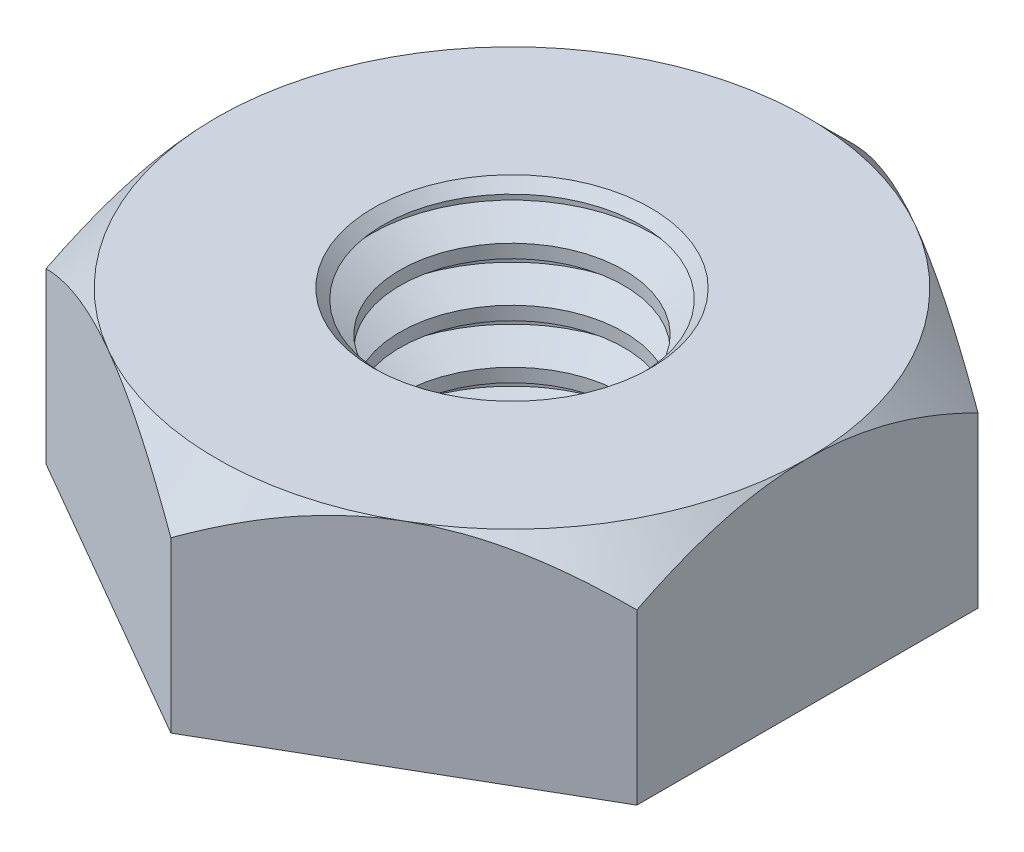
ISO-10303-21;
HEADER;
FILE_DESCRIPTION(('STEP AP214'),'2;1');
FILE_NAME('part.step','',(''),(''),'','','');
FILE_SCHEMA(('AUTOMOTIVE_DESIGN { 1 0 10303 214 1 1 1 1 }'));
ENDSEC;
DATA;
#1=APPLICATION_CONTEXT('core data for automotive mechanical design processes');
#2=APPLICATION_PROTOCOL_DEFINITION('international standard','automotive_design',2000,#1);
#3=PRODUCT_CONTEXT('',#1,'mechanical');
#4=PRODUCT('Part','Part','',(#3));
#5=PRODUCT_RELATED_PRODUCT_CATEGORY('part','',(#4));
#6=PRODUCT_DEFINITION_FORMATION('','',#4);
#7=PRODUCT_DEFINITION_CONTEXT('part definition',#1,'design');
#8=PRODUCT_DEFINITION('design','',#6,#7);
#9=PRODUCT_DEFINITION_SHAPE('','',#8);
#10=(LENGTH_UNIT() NAMED_UNIT(*) SI_UNIT(.MILLI.,.METRE.));
#11=(NAMED_UNIT(*) PLANE_ANGLE_UNIT() SI_UNIT($,.RADIAN.));
#12=(NAMED_UNIT(*) SI_UNIT($,.STERADIAN.) SOLID_ANGLE_UNIT());
#13=UNCERTAINTY_MEASURE_WITH_UNIT(LENGTH_MEASURE(1.E-05),#10,'distance_accuracy_value','');
#14=(GEOMETRIC_REPRESENTATION_CONTEXT(3) GLOBAL_UNCERTAINTY_ASSIGNED_CONTEXT((#13)) GLOBAL_UNIT_ASSIGNED_CONTEXT((#10,
#11,#12)) REPRESENTATION_CONTEXT('',''));
#15=CARTESIAN_POINT('',(0.,0.,0.));
#16=DIRECTION('',(0.,0.,1.));
#17=DIRECTION('',(1.,0.,0.));
#18=AXIS2_PLACEMENT_3D('',#15,#16,#17);
#19=CARTESIAN_POINT('',(0.,0.,-5.04098953786192));
#20=DIRECTION('',(0.,1.,0.));
#21=DIRECTION('',(0.,0.,1.));
#22=AXIS2_PLACEMENT_3D('',#19,#20,#21);
#23=PLANE('',#22);
#24=DIRECTION('',(-0.866025403784439,0.,-0.5));
#25=VECTOR('',#24,1.);
#26=CARTESIAN_POINT('',(4.365625,0.,-2.52049476893096));
#27=LINE('',#26,#25);
#28=CARTESIAN_POINT('',(4.365625,0.,-2.52049476893096));
#29=VERTEX_POINT('',#28);
#30=CARTESIAN_POINT('',(0.,0.,-5.04098953786192));
#31=VERTEX_POINT('',#30);
#32=EDGE_CURVE('E261',#29,#31,#27,.T.);
#33=ORIENTED_EDGE('',*,*,#32,.F.);
#34=DIRECTION('',(0.,0.,-1.));
#35=VECTOR('',#34,1.);
#36=CARTESIAN_POINT('',(4.365625,0.,2.52049476893096));
#37=LINE('',#36,#35);
#38=CARTESIAN_POINT('',(4.365625,0.,2.52049476893096));
#39=VERTEX_POINT('',#38);
#40=EDGE_CURVE('E268',#39,#29,#37,.T.);
#41=ORIENTED_EDGE('',*,*,#40,.F.);
#42=DIRECTION('',(0.866025403784439,0.,-0.5));
#43=VECTOR('',#42,1.);
#44=CARTESIAN_POINT('',(0.,0.,5.04098953786192));
#45=LINE('',#44,#43);
#46=CARTESIAN_POINT('',(0.,0.,5.04098953786192));
#47=VERTEX_POINT('',#46);
#48=EDGE_CURVE('E264',#47,#39,#45,.T.);
#49=ORIENTED_EDGE('',*,*,#48,.F.);
#50=DIRECTION('',(0.866025403784439,0.,0.5));
#51=VECTOR('',#50,1.);
#52=CARTESIAN_POINT('',(-4.365625,0.,2.52049476893096));
#53=LINE('',#52,#51);
#54=CARTESIAN_POINT('',(-4.365625,0.,2.52049476893096));
#55=VERTEX_POINT('',#54);
#56=EDGE_CURVE('E127',#55,#47,#53,.T.);
#57=ORIENTED_EDGE('',*,*,#56,.F.);
#58=DIRECTION('',(0.,0.,1.));
#59=VECTOR('',#58,1.);
#60=CARTESIAN_POINT('',(-4.365625,0.,-2.52049476893096));
#61=LINE('',#60,#59);
#62=CARTESIAN_POINT('',(-4.365625,0.,-2.52049476893096));
#63=VERTEX_POINT('',#62);
#64=EDGE_CURVE('E260',#63,#55,#61,.T.);
#65=ORIENTED_EDGE('',*,*,#64,.F.);
#66=DIRECTION('',(-0.866025403784439,0.,0.5));
#67=VECTOR('',#66,1.);
#68=CARTESIAN_POINT('',(0.,0.,-5.04098953786192));
#69=LINE('',#68,#67);
#70=EDGE_CURVE('E256',#31,#63,#69,.T.);
#71=ORIENTED_EDGE('',*,*,#70,.F.);
#72=EDGE_LOOP('',(#33,#41,#49,#57,#65,#71));
#73=FACE_BOUND('',#72,.T.);
#74=CARTESIAN_POINT('',(0.,0.,0.));
#75=DIRECTION('',(0.,1.,0.));
#76=DIRECTION('',(0.,0.,1.));
#77=AXIS2_PLACEMENT_3D('',#74,#75,#76);
#78=CIRCLE('',#77,1.65317020984131);
#79=CARTESIAN_POINT('',(0.,0.,1.65317020984131));
#80=VERTEX_POINT('',#79);
#81=EDGE_CURVE('E339',#80,#80,#78,.T.);
#82=ORIENTED_EDGE('',*,*,#81,.T.);
#83=EDGE_LOOP('',(#82));
#84=FACE_BOUND('',#83,.T.);
#85=ADVANCED_FACE('F34',(#73,#84),#23,.F.);
#86=CARTESIAN_POINT('',(0.,3.175,-5.04098953786192));
#87=DIRECTION('',(0.,1.,0.));
#88=DIRECTION('',(0.,0.,1.));
#89=AXIS2_PLACEMENT_3D('',#86,#87,#88);
#90=PLANE('',#89);
#91=CARTESIAN_POINT('',(0.,3.175,0.));
#92=DIRECTION('',(0.,1.,0.));
#93=DIRECTION('',(0.,0.,1.));
#94=AXIS2_PLACEMENT_3D('',#91,#92,#93);
#95=CIRCLE('',#94,2.05004520984131);
#96=CARTESIAN_POINT('',(0.,3.175,2.05004520984131));
#97=VERTEX_POINT('',#96);
#98=EDGE_CURVE('E12',#97,#97,#95,.F.);
#99=ORIENTED_EDGE('',*,*,#98,.T.);
#100=EDGE_LOOP('',(#99));
#101=FACE_BOUND('',#100,.T.);
#102=CARTESIAN_POINT('',(0.,3.175,0.));
#103=DIRECTION('',(0.,1.,0.));
#104=DIRECTION('',(0.,0.,1.));
#105=AXIS2_PLACEMENT_3D('',#102,#103,#104);
#106=CIRCLE('',#105,4.365625);
#107=CARTESIAN_POINT('',(-2.1828125,3.175,3.78074215339644));
#108=VERTEX_POINT('',#107);
#109=CARTESIAN_POINT('',(2.1828125,3.175,3.78074215339644));
#110=VERTEX_POINT('',#109);
#111=EDGE_CURVE('E109',#108,#110,#106,.T.);
#112=ORIENTED_EDGE('',*,*,#111,.T.);
#113=CARTESIAN_POINT('',(0.,3.175,0.));
#114=DIRECTION('',(0.,1.,0.));
#115=DIRECTION('',(0.,0.,1.));
#116=AXIS2_PLACEMENT_3D('',#113,#114,#115);
#117=CIRCLE('',#116,4.365625);
#118=CARTESIAN_POINT('',(4.365625,3.175,0.));
#119=VERTEX_POINT('',#118);
#120=EDGE_CURVE('E49',#110,#119,#117,.T.);
#121=ORIENTED_EDGE('',*,*,#120,.T.);
#122=CARTESIAN_POINT('',(2.1828125,3.175,-3.78074215339644));
#123=VERTEX_POINT('',#122);
#124=EDGE_CURVE('E142',#119,#123,#106,.T.);
#125=ORIENTED_EDGE('',*,*,#124,.T.);
#126=CARTESIAN_POINT('',(-2.1828125,3.175,-3.78074215339644));
#127=VERTEX_POINT('',#126);
#128=EDGE_CURVE('E146',#123,#127,#106,.T.);
#129=ORIENTED_EDGE('',*,*,#128,.T.);
#130=CARTESIAN_POINT('',(-4.365625,3.175,0.));
#131=VERTEX_POINT('',#130);
#132=EDGE_CURVE('E149',#127,#131,#106,.T.);
#133=ORIENTED_EDGE('',*,*,#132,.T.);
#134=EDGE_CURVE('E141',#131,#108,#106,.T.);
#135=ORIENTED_EDGE('',*,*,#134,.T.);
#136=EDGE_LOOP('',(#112,#121,#125,#129,#133,#135));
#137=FACE_BOUND('',#136,.T.);
#138=ADVANCED_FACE('F156',(#101,#137),#90,.T.);
#139=CARTESIAN_POINT('',(4.365625,3.175,-2.52049476893096));
#140=DIRECTION('',(-0.5,0.,0.866025403784439));
#141=DIRECTION('',(0.866025403784439,0.,0.5));
#142=AXIS2_PLACEMENT_3D('',#139,#140,#141);
#143=PLANE('',#142);
#144=CARTESIAN_POINT('',(4.365825,2.49951998811687,-2.52037929887713));
#145=CARTESIAN_POINT('',(4.29075926179721,2.5428556843937,-2.56371852303542));
#146=CARTESIAN_POINT('',(4.21511652405691,2.58486150694082,-2.60739087803202));
#147=CARTESIAN_POINT('',(4.06256384257887,2.66580884918542,-2.69546720974897));
#148=CARTESIAN_POINT('',(3.98565323405556,2.70474869521597,-2.73987157028344));
#149=CARTESIAN_POINT('',(3.75213521872552,2.81669452590529,-2.87469325929487));
#150=CARTESIAN_POINT('',(3.59355091897805,2.88434920314825,-2.96625194744332));
#151=CARTESIAN_POINT('',(3.27375295789606,3.00020333018922,-3.1508873863603));
#152=CARTESIAN_POINT('',(3.11262104210945,3.04869466909121,-3.24391694131474));
#153=CARTESIAN_POINT('',(2.86827398509099,3.1047873481826,-3.38499078046004));
#154=CARTESIAN_POINT('',(2.78646520845363,3.12070335091413,-3.43222309967369));
#155=CARTESIAN_POINT('',(2.62215493673047,3.14662706744581,-3.52708767928368));
#156=CARTESIAN_POINT('',(2.53965354705096,3.15663566431487,-3.57471987882366));
#157=CARTESIAN_POINT('',(2.33861197089847,3.17341632845891,-3.69079128693361));
#158=CARTESIAN_POINT('',(2.21985517581475,3.17693743451113,-3.7593555545433));
#159=CARTESIAN_POINT('',(1.9825555950651,3.17102881515628,-3.89636053136769));
#160=CARTESIAN_POINT('',(1.8640128990038,3.16159454983167,-3.96480118884914));
#161=CARTESIAN_POINT('',(1.62804507322986,3.13033130179081,-4.10103727657982));
#162=CARTESIAN_POINT('',(1.51062134300582,3.10848845674929,-4.16883189883392));
#163=CARTESIAN_POINT('',(1.27779209770266,3.05359557133502,-4.30325592628492));
#164=CARTESIAN_POINT('',(1.16238642859219,3.02054639026254,-4.36988542041185));
#165=CARTESIAN_POINT('',(0.957514998599648,2.95255207631629,-4.48816799566731));
#166=CARTESIAN_POINT('',(0.867595701157639,2.91939475932441,-4.5400829262508));
#167=CARTESIAN_POINT('',(0.689371364291638,2.84773661607479,-4.64298079511653));
#168=CARTESIAN_POINT('',(0.601066374030605,2.80923562738386,-4.69396370501452));
#169=CARTESIAN_POINT('',(0.42634877155884,2.72775327359755,-4.79483695983376));
#170=CARTESIAN_POINT('',(0.339931190163336,2.68478599766642,-4.84473017371517));
#171=CARTESIAN_POINT('',(0.168696346553443,2.59493525616829,-4.94359265676799));
#172=CARTESIAN_POINT('',(0.0838781412149917,2.54805419303698,-4.99256247045232));
#173=CARTESIAN_POINT('',(-0.000200000000001605,2.49951998811686,-5.04110500791576));
#174=B_SPLINE_CURVE_WITH_KNOTS('',3,(#144,#145,#146,#147,#148,#149,#150,#151,#152,#153,#154,
#155,#156,#157,#158,#159,#160,#161,#162,#163,#164,#165,#166,#167,#168,#169,#170,#171,#172,#173),
.UNSPECIFIED.,.F.,.F.,(4,2,2,2,2,2,2,2,2,2,2,2,2,2,4),(0.,0.290706610356815,0.581570828097977,
1.16643976138302,1.74202094661304,2.02924700568145,2.31643011786515,2.72731191561999,
3.13833773437735,3.54982363883689,3.96127799774813,4.28811145534738,4.61495484997813,
4.94079680753749,5.26644020086356),.UNSPECIFIED.);
#175=CARTESIAN_POINT('',(4.365625,2.49963546213808,-2.52049476893097));
#176=VERTEX_POINT('',#175);
#177=EDGE_CURVE('E271',#176,#123,#174,.T.);
#178=ORIENTED_EDGE('',*,*,#177,.F.);
#179=DIRECTION('',(0.,-1.,0.));
#180=VECTOR('',#179,1.);
#181=CARTESIAN_POINT('',(4.365625,3.175,-2.52049476893096));
#182=LINE('',#181,#180);
#183=EDGE_CURVE('E134',#176,#29,#182,.T.);
#184=ORIENTED_EDGE('',*,*,#183,.T.);
#185=ORIENTED_EDGE('',*,*,#32,.T.);
#186=DIRECTION('',(0.,-1.,0.));
#187=VECTOR('',#186,1.);
#188=CARTESIAN_POINT('',(0.,3.175,-5.04098953786192));
#189=LINE('',#188,#187);
#190=CARTESIAN_POINT('',(0.,2.49963546213808,-5.04098953786192));
#191=VERTEX_POINT('',#190);
#192=EDGE_CURVE('E139',#191,#31,#189,.T.);
#193=ORIENTED_EDGE('',*,*,#192,.F.);
#194=EDGE_CURVE('E208',#123,#191,#174,.T.);
#195=ORIENTED_EDGE('',*,*,#194,.F.);
#196=EDGE_LOOP('',(#178,#184,#185,#193,#195));
#197=FACE_BOUND('',#196,.T.);
#198=ADVANCED_FACE('F217',(#197),#143,.F.);
#199=CARTESIAN_POINT('',(0.,3.175,-5.04098953786192));
#200=DIRECTION('',(0.5,0.,0.866025403784439));
#201=DIRECTION('',(0.866025403784439,0.,-0.5));
#202=AXIS2_PLACEMENT_3D('',#199,#200,#201);
#203=PLANE('',#202);
#204=CARTESIAN_POINT('',(0.000199999999998374,2.49951998811686,-5.04110500791576));
#205=CARTESIAN_POINT('',(-0.0748657382027902,2.54285568439369,-4.99776578375746));
#206=CARTESIAN_POINT('',(-0.150508475943085,2.58486150694081,-4.95409342876086));
#207=CARTESIAN_POINT('',(-0.30306115742113,2.66580884918542,-4.86601709704392));
#208=CARTESIAN_POINT('',(-0.379971765944441,2.70474869521597,-4.82161273650944));
#209=CARTESIAN_POINT('',(-0.613489781274479,2.81669452590529,-4.68679104749802));
#210=CARTESIAN_POINT('',(-0.772074081021948,2.88434920314825,-4.59523235934957));
#211=CARTESIAN_POINT('',(-1.09187204210394,3.00020333018922,-4.41059692043259));
#212=CARTESIAN_POINT('',(-1.25300395789055,3.0486946690912,-4.31756736547815));
#213=CARTESIAN_POINT('',(-1.49735101490901,3.1047873481826,-4.17649352633285));
#214=CARTESIAN_POINT('',(-1.57915979154637,3.12070335091412,-4.1292612071192));
#215=CARTESIAN_POINT('',(-1.74347006326953,3.14662706744581,-4.03439662750921));
#216=CARTESIAN_POINT('',(-1.82597145294904,3.15663566431487,-3.98676442796922));
#217=CARTESIAN_POINT('',(-2.02701302910153,3.17341632845891,-3.87069301985927));
#218=CARTESIAN_POINT('',(-2.14576982418526,3.17693743451113,-3.80212875224959));
#219=CARTESIAN_POINT('',(-2.3830694049349,3.17102881515628,-3.6651237754252));
#220=CARTESIAN_POINT('',(-2.5016121009962,3.16159454983167,-3.59668311794374));
#221=CARTESIAN_POINT('',(-2.73757992677014,3.13033130179081,-3.46044703021306));
#222=CARTESIAN_POINT('',(-2.85500365699418,3.10848845674929,-3.39265240795897));
#223=CARTESIAN_POINT('',(-3.08783290229734,3.05359557133502,-3.25822838050797));
#224=CARTESIAN_POINT('',(-3.20323857140781,3.02054639026254,-3.19159888638103));
#225=CARTESIAN_POINT('',(-3.40811000140035,2.95255207631629,-3.07331631112557));
#226=CARTESIAN_POINT('',(-3.49802929884236,2.91939475932441,-3.02140138054209));
#227=CARTESIAN_POINT('',(-3.67625363570836,2.84773661607479,-2.91850351167636));
#228=CARTESIAN_POINT('',(-3.7645586259694,2.80923562738386,-2.86752060177837));
#229=CARTESIAN_POINT('',(-3.93927622844116,2.72775327359755,-2.76664734695913));
#230=CARTESIAN_POINT('',(-4.02569380983666,2.68478599766642,-2.71675413307772));
#231=CARTESIAN_POINT('',(-4.19692865344656,2.59493525616829,-2.6178916500249));
#232=CARTESIAN_POINT('',(-4.28174685878501,2.54805419303698,-2.56892183634056));
#233=CARTESIAN_POINT('',(-4.365825,2.49951998811686,-2.52037929887712));
#234=B_SPLINE_CURVE_WITH_KNOTS('',3,(#204,#205,#206,#207,#208,#209,#210,#211,#212,#213,#214,
#215,#216,#217,#218,#219,#220,#221,#222,#223,#224,#225,#226,#227,#228,#229,#230,#231,#232,#233),
.UNSPECIFIED.,.F.,.F.,(4,2,2,2,2,2,2,2,2,2,2,2,2,2,4),(0.,0.290706610356816,0.581570828097979,
1.16643976138302,1.74202094661305,2.02924700568145,2.31643011786515,2.72731191561999,
3.13833773437736,3.54982363883689,3.96127799774814,4.28811145534738,4.61495484997813,
4.94079680753749,5.26644020086356),.UNSPECIFIED.);
#235=EDGE_CURVE('E207',#191,#127,#234,.T.);
#236=ORIENTED_EDGE('',*,*,#235,.F.);
#237=ORIENTED_EDGE('',*,*,#192,.T.);
#238=ORIENTED_EDGE('',*,*,#70,.T.);
#239=DIRECTION('',(0.,-1.,0.));
#240=VECTOR('',#239,1.);
#241=CARTESIAN_POINT('',(-4.365625,3.175,-2.52049476893096));
#242=LINE('',#241,#240);
#243=CARTESIAN_POINT('',(-4.365625,2.49963546213808,-2.52049476893097));
#244=VERTEX_POINT('',#243);
#245=EDGE_CURVE('E132',#244,#63,#242,.T.);
#246=ORIENTED_EDGE('',*,*,#245,.F.);
#247=EDGE_CURVE('E202',#127,#244,#234,.T.);
#248=ORIENTED_EDGE('',*,*,#247,.F.);
#249=EDGE_LOOP('',(#236,#237,#238,#246,#248));
#250=FACE_BOUND('',#249,.T.);
#251=ADVANCED_FACE('F213',(#250),#203,.F.);
#252=CARTESIAN_POINT('',(-4.365625,3.175,-2.52049476893096));
#253=DIRECTION('',(1.,0.,0.));
#254=DIRECTION('',(0.,0.,-1.));
#255=AXIS2_PLACEMENT_3D('',#252,#253,#254);
#256=PLANE('',#255);
#257=CARTESIAN_POINT('',(-4.365625,0.704912579661346,-5.26006489056433));
#258=CARTESIAN_POINT('',(-4.365625,0.80267892983793,-5.1329841859818));
#259=CARTESIAN_POINT('',(-4.365625,0.899569220714148,-5.00521874689069));
#260=CARTESIAN_POINT('',(-4.365625,1.09119744425269,-4.7480385262146));
#261=CARTESIAN_POINT('',(-4.365625,1.18593486227081,-4.6186233615674));
#262=CARTESIAN_POINT('',(-4.365625,1.37353129405869,-4.35691808766542));
#263=CARTESIAN_POINT('',(-4.365625,1.46637017769497,-4.22461350133101));
#264=CARTESIAN_POINT('',(-4.365625,1.64881712700763,-3.95780239294876));
#265=CARTESIAN_POINT('',(-4.365625,1.73842541514534,-3.82329602344843));
#266=CARTESIAN_POINT('',(-4.365625,1.91923152416555,-3.54310038592311));
#267=CARTESIAN_POINT('',(-4.365625,2.0101698538518,-3.39724282764264));
#268=CARTESIAN_POINT('',(-4.365625,2.18640211336186,-3.10210247150436));
#269=CARTESIAN_POINT('',(-4.365625,2.27169509328475,-2.95281910287325));
#270=CARTESIAN_POINT('',(-4.365625,2.43482022055583,-2.65078628816501));
#271=CARTESIAN_POINT('',(-4.365625,2.51267426921964,-2.49804876401671));
#272=CARTESIAN_POINT('',(-4.365625,2.65917723070185,-2.18825597231203));
#273=CARTESIAN_POINT('',(-4.365625,2.72783048599296,-2.03120278408456));
#274=CARTESIAN_POINT('',(-4.365625,2.84724495878238,-1.72816423864564));
#275=CARTESIAN_POINT('',(-4.365625,2.89910313311,-1.5826155847136));
#276=CARTESIAN_POINT('',(-4.365625,2.99116920619303,-1.2878101350948));
#277=CARTESIAN_POINT('',(-4.365625,3.03137636289258,-1.1385531038777));
#278=CARTESIAN_POINT('',(-4.365625,3.09729383406965,-0.83982185436757));
#279=CARTESIAN_POINT('',(-4.365625,3.12326744800821,-0.690406728134636));
#280=CARTESIAN_POINT('',(-4.365625,3.16017597579481,-0.389720117691568));
#281=CARTESIAN_POINT('',(-4.365625,3.17111400974627,-0.238449025197239));
#282=CARTESIAN_POINT('',(-4.365625,3.1770196548063,0.0577907271338069));
#283=CARTESIAN_POINT('',(-4.365625,3.17266407223423,0.202746020460245));
#284=CARTESIAN_POINT('',(-4.365625,3.14977668074263,0.491525443469046));
#285=CARTESIAN_POINT('',(-4.365625,3.13124358417651,0.635349469207359));
#286=CARTESIAN_POINT('',(-4.365625,3.08073406930188,0.923262931460914));
#287=CARTESIAN_POINT('',(-4.365625,3.04852030695866,1.0673100183025));
#288=CARTESIAN_POINT('',(-4.365625,2.97243663849279,1.35223202145247));
#289=CARTESIAN_POINT('',(-4.365625,2.92856739438755,1.49310711743332));
#290=CARTESIAN_POINT('',(-4.365625,2.82829132796462,1.77944606428932));
#291=CARTESIAN_POINT('',(-4.365625,2.77130692063028,1.92470532838635));
#292=CARTESIAN_POINT('',(-4.365625,2.64853439221219,2.21148751875443));
#293=CARTESIAN_POINT('',(-4.365625,2.58274230151922,2.35300872565198));
#294=CARTESIAN_POINT('',(-4.365625,2.44391465170222,2.63298314411336));
#295=CARTESIAN_POINT('',(-4.365625,2.37085678258171,2.77142520257403));
#296=CARTESIAN_POINT('',(-4.365625,2.219105296034,3.04513698555421));
#297=CARTESIAN_POINT('',(-4.365625,2.14041254634271,3.18040719427782));
#298=CARTESIAN_POINT('',(-4.365625,1.98248926861825,3.44157865405833));
#299=CARTESIAN_POINT('',(-4.365625,1.9034771910414,3.56761269781683));
#300=CARTESIAN_POINT('',(-4.365625,1.74208988391647,3.81751542571875));
#301=CARTESIAN_POINT('',(-4.365625,1.65971440221839,3.9413839465179));
#302=CARTESIAN_POINT('',(-4.365625,1.4928706732036,4.18624305036429));
#303=CARTESIAN_POINT('',(-4.365625,1.40842453863359,4.30724875510755));
#304=CARTESIAN_POINT('',(-4.365625,1.23726856590243,4.54760013073487));
#305=CARTESIAN_POINT('',(-4.365625,1.1505593581824,4.66694625003688));
#306=CARTESIAN_POINT('',(-4.365625,1.06292381609541,4.78559619977847));
#307=B_SPLINE_CURVE_WITH_KNOTS('',3,(#257,#258,#259,#260,#261,#262,#263,#264,#265,#266,#267,
#268,#269,#270,#271,#272,#273,#274,#275,#276,#277,#278,#279,#280,#281,#282,#283,#284,#285,#286,
#287,#288,#289,#290,#291,#292,#293,#294,#295,#296,#297,#298,#299,#300,#301,#302,#303,#304,#305,
#306),.UNSPECIFIED.,.F.,.F.,(4,2,2,2,2,2,2,2,2,2,2,2,2,2,2,2,2,2,2,2,2,2,2,2,4),(0.,
0.481018057807076,0.962149918440635,1.44699361883673,1.93180386850032,2.44735513975326,
2.96299293959461,3.47706255965263,3.99088869478828,4.4540225010778,4.91718579798021,
5.37146415229228,5.82564822294318,6.25999088997209,6.69437301005721,7.13662055973024,
7.57884299564045,8.04659469469021,8.51455792293897,8.98400523488901,9.45338040975317,
9.89957717259381,10.3458074478608,10.7884549913015,11.2309805122862),.UNSPECIFIED.);
#308=EDGE_CURVE('E161',#244,#131,#307,.T.);
#309=ORIENTED_EDGE('',*,*,#308,.F.);
#310=ORIENTED_EDGE('',*,*,#245,.T.);
#311=ORIENTED_EDGE('',*,*,#64,.T.);
#312=DIRECTION('',(0.,-1.,0.));
#313=VECTOR('',#312,1.);
#314=CARTESIAN_POINT('',(-4.365625,3.175,2.52049476893096));
#315=LINE('',#314,#313);
#316=CARTESIAN_POINT('',(-4.36562500000001,2.49963546213808,2.52049476893096));
#317=VERTEX_POINT('',#316);
#318=EDGE_CURVE('E129',#317,#55,#315,.T.);
#319=ORIENTED_EDGE('',*,*,#318,.F.);
#320=EDGE_CURVE('E159',#131,#317,#307,.T.);
#321=ORIENTED_EDGE('',*,*,#320,.F.);
#322=EDGE_LOOP('',(#309,#310,#311,#319,#321));
#323=FACE_BOUND('',#322,.T.);
#324=ADVANCED_FACE('F216',(#323),#256,.F.);
#325=CARTESIAN_POINT('',(-4.365625,3.175,2.52049476893096));
#326=DIRECTION('',(0.5,0.,-0.866025403784439));
#327=DIRECTION('',(-0.866025403784439,0.,-0.5));
#328=AXIS2_PLACEMENT_3D('',#325,#326,#327);
#329=PLANE('',#328);
#330=CARTESIAN_POINT('',(-4.365825,2.49951998811686,2.52037929887712));
#331=CARTESIAN_POINT('',(-4.29075926179721,2.5428556843937,2.56371852303542));
#332=CARTESIAN_POINT('',(-4.21511652405692,2.58486150694082,2.60739087803202));
#333=CARTESIAN_POINT('',(-4.06256384257887,2.66580884918542,2.69546720974897));
#334=CARTESIAN_POINT('',(-3.98565323405556,2.70474869521597,2.73987157028344));
#335=CARTESIAN_POINT('',(-3.75213521872552,2.81669452590529,2.87469325929486));
#336=CARTESIAN_POINT('',(-3.59355091897806,2.88434920314825,2.96625194744331));
#337=CARTESIAN_POINT('',(-3.27375295789606,3.00020333018922,3.1508873863603));
#338=CARTESIAN_POINT('',(-3.11262104210946,3.04869466909121,3.24391694131473));
#339=CARTESIAN_POINT('',(-2.86827398509099,3.1047873481826,3.38499078046004));
#340=CARTESIAN_POINT('',(-2.78646520845364,3.12070335091413,3.43222309967369));
#341=CARTESIAN_POINT('',(-2.62215493673047,3.14662706744582,3.52708767928368));
#342=CARTESIAN_POINT('',(-2.53965354705096,3.15663566431487,3.57471987882366));
#343=CARTESIAN_POINT('',(-2.33861197089847,3.17341632845892,3.69079128693361));
#344=CARTESIAN_POINT('',(-2.21985517581475,3.17693743451114,3.75935555454329));
#345=CARTESIAN_POINT('',(-1.98255559506511,3.17102881515629,3.89636053136768));
#346=CARTESIAN_POINT('',(-1.8640128990038,3.16159454983167,3.96480118884914));
#347=CARTESIAN_POINT('',(-1.62804507322986,3.13033130179081,4.10103727657982));
#348=CARTESIAN_POINT('',(-1.51062134300582,3.10848845674929,4.16883189883391));
#349=CARTESIAN_POINT('',(-1.27779209770266,3.05359557133503,4.30325592628491));
#350=CARTESIAN_POINT('',(-1.16238642859219,3.02054639026254,4.36988542041185));
#351=CARTESIAN_POINT('',(-0.957514998599652,2.9525520763163,4.48816799566731));
#352=CARTESIAN_POINT('',(-0.867595701157642,2.91939475932441,4.54008292625079));
#353=CARTESIAN_POINT('',(-0.689371364291641,2.8477366160748,4.64298079511652));
#354=CARTESIAN_POINT('',(-0.601066374030608,2.80923562738387,4.69396370501451));
#355=CARTESIAN_POINT('',(-0.426348771558844,2.72775327359756,4.79483695983375));
#356=CARTESIAN_POINT('',(-0.339931190163339,2.68478599766643,4.84473017371517));
#357=CARTESIAN_POINT('',(-0.168696346553447,2.5949352561683,4.94359265676798));
#358=CARTESIAN_POINT('',(-0.0838781412149956,2.54805419303699,4.99256247045232));
#359=CARTESIAN_POINT('',(0.000199999999997297,2.49951998811687,5.04110500791575));
#360=B_SPLINE_CURVE_WITH_KNOTS('',3,(#330,#331,#332,#333,#334,#335,#336,#337,#338,#339,#340,
#341,#342,#343,#344,#345,#346,#347,#348,#349,#350,#351,#352,#353,#354,#355,#356,#357,#358,#359),
.UNSPECIFIED.,.F.,.F.,(4,2,2,2,2,2,2,2,2,2,2,2,2,2,4),(0.,0.290706610356816,0.581570828097978,
1.16643976138302,1.74202094661304,2.02924700568145,2.31643011786515,2.72731191561999,
3.13833773437736,3.54982363883689,3.96127799774813,4.28811145534738,4.61495484997813,
4.94079680753749,5.26644020086355),.UNSPECIFIED.);
#361=EDGE_CURVE('E114',#317,#108,#360,.T.);
#362=ORIENTED_EDGE('',*,*,#361,.F.);
#363=ORIENTED_EDGE('',*,*,#318,.T.);
#364=ORIENTED_EDGE('',*,*,#56,.T.);
#365=DIRECTION('',(0.,-1.,0.));
#366=VECTOR('',#365,1.);
#367=CARTESIAN_POINT('',(0.,3.175,5.04098953786192));
#368=LINE('',#367,#366);
#369=CARTESIAN_POINT('',(0.,2.49963546213808,5.04098953786192));
#370=VERTEX_POINT('',#369);
#371=EDGE_CURVE('E120',#370,#47,#368,.T.);
#372=ORIENTED_EDGE('',*,*,#371,.F.);
#373=EDGE_CURVE('E105',#108,#370,#360,.T.);
#374=ORIENTED_EDGE('',*,*,#373,.F.);
#375=EDGE_LOOP('',(#362,#363,#364,#372,#374));
#376=FACE_BOUND('',#375,.T.);
#377=ADVANCED_FACE('F125',(#376),#329,.F.);
#378=CARTESIAN_POINT('',(0.,3.175,5.04098953786192));
#379=DIRECTION('',(-0.5,0.,-0.866025403784439));
#380=DIRECTION('',(-0.866025403784439,0.,0.5));
#381=AXIS2_PLACEMENT_3D('',#378,#379,#380);
#382=PLANE('',#381);
#383=CARTESIAN_POINT('',(-0.00020000000000279,2.49951998811687,5.04110500791576));
#384=CARTESIAN_POINT('',(0.0748657382027853,2.5428556843937,4.99776578375746));
#385=CARTESIAN_POINT('',(0.15050847594308,2.58486150694082,4.95409342876086));
#386=CARTESIAN_POINT('',(0.303061157421125,2.66580884918542,4.86601709704391));
#387=CARTESIAN_POINT('',(0.379971765944435,2.70474869521597,4.82161273650944));
#388=CARTESIAN_POINT('',(0.613489781274473,2.8166945259053,4.68679104749801));
#389=CARTESIAN_POINT('',(0.772074081021943,2.88434920314826,4.59523235934957));
#390=CARTESIAN_POINT('',(1.09187204210394,3.00020333018922,4.41059692043258));
#391=CARTESIAN_POINT('',(1.25300395789054,3.04869466909121,4.31756736547815));
#392=CARTESIAN_POINT('',(1.49735101490901,3.1047873481826,4.17649352633284));
#393=CARTESIAN_POINT('',(1.57915979154636,3.12070335091413,4.12926120711919));
#394=CARTESIAN_POINT('',(1.74347006326953,3.14662706744582,4.0343966275092));
#395=CARTESIAN_POINT('',(1.82597145294903,3.15663566431487,3.98676442796922));
#396=CARTESIAN_POINT('',(2.02701302910153,3.17341632845892,3.87069301985927));
#397=CARTESIAN_POINT('',(2.14576982418525,3.17693743451114,3.80212875224959));
#398=CARTESIAN_POINT('',(2.38306940493489,3.17102881515629,3.6651237754252));
#399=CARTESIAN_POINT('',(2.5016121009962,3.16159454983167,3.59668311794374));
#400=CARTESIAN_POINT('',(2.73757992677014,3.13033130179081,3.46044703021306));
#401=CARTESIAN_POINT('',(2.85500365699418,3.10848845674929,3.39265240795896));
#402=CARTESIAN_POINT('',(3.08783290229733,3.05359557133503,3.25822838050797));
#403=CARTESIAN_POINT('',(3.20323857140781,3.02054639026254,3.19159888638103));
#404=CARTESIAN_POINT('',(3.40811000140035,2.9525520763163,3.07331631112557));
#405=CARTESIAN_POINT('',(3.49802929884236,2.91939475932441,3.02140138054209));
#406=CARTESIAN_POINT('',(3.67625363570836,2.8477366160748,2.91850351167636));
#407=CARTESIAN_POINT('',(3.76455862596939,2.80923562738387,2.86752060177836));
#408=CARTESIAN_POINT('',(3.93927622844116,2.72775327359755,2.76664734695912));
#409=CARTESIAN_POINT('',(4.02569380983666,2.68478599766643,2.71675413307771));
#410=CARTESIAN_POINT('',(4.19692865344655,2.5949352561683,2.6178916500249));
#411=CARTESIAN_POINT('',(4.281746858785,2.54805419303699,2.56892183634056));
#412=CARTESIAN_POINT('',(4.365825,2.49951998811687,2.52037929887712));
#413=B_SPLINE_CURVE_WITH_KNOTS('',3,(#383,#384,#385,#386,#387,#388,#389,#390,#391,#392,#393,
#394,#395,#396,#397,#398,#399,#400,#401,#402,#403,#404,#405,#406,#407,#408,#409,#410,#411,#412),
.UNSPECIFIED.,.F.,.F.,(4,2,2,2,2,2,2,2,2,2,2,2,2,2,4),(0.,0.290706610356815,0.581570828097978,
1.16643976138302,1.74202094661304,2.02924700568145,2.31643011786515,2.72731191561999,
3.13833773437735,3.54982363883689,3.96127799774813,4.28811145534738,4.61495484997813,
4.94079680753749,5.26644020086356),.UNSPECIFIED.);
#414=EDGE_CURVE('E108',#370,#110,#413,.T.);
#415=ORIENTED_EDGE('',*,*,#414,.F.);
#416=ORIENTED_EDGE('',*,*,#371,.T.);
#417=ORIENTED_EDGE('',*,*,#48,.T.);
#418=DIRECTION('',(0.,-1.,0.));
#419=VECTOR('',#418,1.);
#420=CARTESIAN_POINT('',(4.365625,3.175,2.52049476893096));
#421=LINE('',#420,#419);
#422=CARTESIAN_POINT('',(4.365625,2.49963546213808,2.52049476893097));
#423=VERTEX_POINT('',#422);
#424=EDGE_CURVE('E130',#423,#39,#421,.T.);
#425=ORIENTED_EDGE('',*,*,#424,.F.);
#426=EDGE_CURVE('E123',#110,#423,#413,.T.);
#427=ORIENTED_EDGE('',*,*,#426,.F.);
#428=EDGE_LOOP('',(#415,#416,#417,#425,#427));
#429=FACE_BOUND('',#428,.T.);
#430=ADVANCED_FACE('F118',(#429),#382,.F.);
#431=CARTESIAN_POINT('',(4.365625,3.175,2.52049476893096));
#432=DIRECTION('',(-1.,0.,0.));
#433=DIRECTION('',(0.,0.,1.));
#434=AXIS2_PLACEMENT_3D('',#431,#432,#433);
#435=PLANE('',#434);
#436=CARTESIAN_POINT('',(4.365625,0.704912579661347,-5.26006489056433));
#437=CARTESIAN_POINT('',(4.365625,0.802678929837931,-5.1329841859818));
#438=CARTESIAN_POINT('',(4.365625,0.899569220714149,-5.0052187468907));
#439=CARTESIAN_POINT('',(4.365625,1.09119744425269,-4.7480385262146));
#440=CARTESIAN_POINT('',(4.365625,1.18593486227081,-4.6186233615674));
#441=CARTESIAN_POINT('',(4.365625,1.3735312940587,-4.35691808766542));
#442=CARTESIAN_POINT('',(4.365625,1.46637017769497,-4.22461350133101));
#443=CARTESIAN_POINT('',(4.365625,1.64881712700764,-3.95780239294876));
#444=CARTESIAN_POINT('',(4.365625,1.73842541514534,-3.82329602344843));
#445=CARTESIAN_POINT('',(4.365625,1.91923152416555,-3.54310038592311));
#446=CARTESIAN_POINT('',(4.365625,2.0101698538518,-3.39724282764265));
#447=CARTESIAN_POINT('',(4.365625,2.18640211336186,-3.10210247150436));
#448=CARTESIAN_POINT('',(4.365625,2.27169509328475,-2.95281910287325));
#449=CARTESIAN_POINT('',(4.365625,2.43482022055583,-2.65078628816501));
#450=CARTESIAN_POINT('',(4.365625,2.51267426921964,-2.49804876401671));
#451=CARTESIAN_POINT('',(4.365625,2.65917723070185,-2.18825597231203));
#452=CARTESIAN_POINT('',(4.365625,2.72783048599296,-2.03120278408456));
#453=CARTESIAN_POINT('',(4.365625,2.84724495878238,-1.72816423864564));
#454=CARTESIAN_POINT('',(4.365625,2.89910313311001,-1.58261558471361));
#455=CARTESIAN_POINT('',(4.365625,2.99116920619303,-1.2878101350948));
#456=CARTESIAN_POINT('',(4.365625,3.03137636289259,-1.1385531038777));
#457=CARTESIAN_POINT('',(4.365625,3.09729383406965,-0.839821854367571));
#458=CARTESIAN_POINT('',(4.365625,3.12326744800821,-0.690406728134637));
#459=CARTESIAN_POINT('',(4.365625,3.16017597579481,-0.389720117691569));
#460=CARTESIAN_POINT('',(4.365625,3.17111400974628,-0.23844902519724));
#461=CARTESIAN_POINT('',(4.365625,3.1770196548063,0.0577907271338055));
#462=CARTESIAN_POINT('',(4.365625,3.17266407223424,0.202746020460243));
#463=CARTESIAN_POINT('',(4.365625,3.14977668074263,0.491525443469045));
#464=CARTESIAN_POINT('',(4.365625,3.13124358417652,0.635349469207358));
#465=CARTESIAN_POINT('',(4.365625,3.08073406930189,0.923262931460913));
#466=CARTESIAN_POINT('',(4.365625,3.04852030695866,1.0673100183025));
#467=CARTESIAN_POINT('',(4.365625,2.97243663849279,1.35223202145247));
#468=CARTESIAN_POINT('',(4.365625,2.92856739438756,1.49310711743332));
#469=CARTESIAN_POINT('',(4.365625,2.82829132796462,1.77944606428932));
#470=CARTESIAN_POINT('',(4.365625,2.77130692063029,1.92470532838634));
#471=CARTESIAN_POINT('',(4.365625,2.64853439221219,2.21148751875443));
#472=CARTESIAN_POINT('',(4.365625,2.58274230151922,2.35300872565198));
#473=CARTESIAN_POINT('',(4.365625,2.44391465170222,2.63298314411336));
#474=CARTESIAN_POINT('',(4.365625,2.37085678258172,2.77142520257403));
#475=CARTESIAN_POINT('',(4.365625,2.219105296034,3.04513698555421));
#476=CARTESIAN_POINT('',(4.365625,2.14041254634271,3.18040719427782));
#477=CARTESIAN_POINT('',(4.365625,1.98248926861825,3.44157865405832));
#478=CARTESIAN_POINT('',(4.365625,1.90347719104141,3.56761269781683));
#479=CARTESIAN_POINT('',(4.365625,1.74208988391648,3.81751542571875));
#480=CARTESIAN_POINT('',(4.365625,1.6597144022184,3.9413839465179));
#481=CARTESIAN_POINT('',(4.365625,1.49287067320361,4.18624305036429));
#482=CARTESIAN_POINT('',(4.365625,1.4084245386336,4.30724875510754));
#483=CARTESIAN_POINT('',(4.365625,1.23726856590244,4.54760013073487));
#484=CARTESIAN_POINT('',(4.365625,1.1505593581824,4.66694625003688));
#485=CARTESIAN_POINT('',(4.365625,1.06292381609542,4.78559619977847));
#486=B_SPLINE_CURVE_WITH_KNOTS('',3,(#436,#437,#438,#439,#440,#441,#442,#443,#444,#445,#446,
#447,#448,#449,#450,#451,#452,#453,#454,#455,#456,#457,#458,#459,#460,#461,#462,#463,#464,#465,
#466,#467,#468,#469,#470,#471,#472,#473,#474,#475,#476,#477,#478,#479,#480,#481,#482,#483,#484,
#485),.UNSPECIFIED.,.F.,.F.,(4,2,2,2,2,2,2,2,2,2,2,2,2,2,2,2,2,2,2,2,2,2,2,2,4),(0.,
0.481018057807077,0.962149918440637,1.44699361883673,1.93180386850032,2.44735513975326,
2.96299293959462,3.47706255965263,3.99088869478828,4.4540225010778,4.91718579798021,
5.37146415229229,5.82564822294318,6.25999088997209,6.69437301005722,7.13662055973025,
7.57884299564045,8.04659469469021,8.51455792293897,8.98400523488901,9.45338040975317,
9.89957717259381,10.3458074478608,10.7884549913015,11.2309805122862),.UNSPECIFIED.);
#487=EDGE_CURVE('E292',#423,#119,#486,.F.);
#488=ORIENTED_EDGE('',*,*,#487,.F.);
#489=ORIENTED_EDGE('',*,*,#424,.T.);
#490=ORIENTED_EDGE('',*,*,#40,.T.);
#491=ORIENTED_EDGE('',*,*,#183,.F.);
#492=EDGE_CURVE('E192',#119,#176,#486,.F.);
#493=ORIENTED_EDGE('',*,*,#492,.F.);
#494=EDGE_LOOP('',(#488,#489,#490,#491,#493));
#495=FACE_BOUND('',#494,.T.);
#496=ADVANCED_FACE('F234',(#495),#435,.F.);
#497=CARTESIAN_POINT('',(0.,3.175,0.));
#498=DIRECTION('',(0.,-1.,0.));
#499=DIRECTION('',(0.,0.,-1.));
#500=AXIS2_PLACEMENT_3D('',#497,#498,#499);
#501=CONICAL_SURFACE('',#500,4.365625,0.785398163397454);
#502=ORIENTED_EDGE('',*,*,#373,.T.);
#503=ORIENTED_EDGE('',*,*,#414,.T.);
#504=ORIENTED_EDGE('',*,*,#111,.F.);
#505=EDGE_LOOP('',(#502,#503,#504));
#506=FACE_BOUND('',#505,.T.);
#507=ADVANCED_FACE('F107',(#506),#501,.T.);
#508=ORIENTED_EDGE('',*,*,#320,.T.);
#509=ORIENTED_EDGE('',*,*,#361,.T.);
#510=ORIENTED_EDGE('',*,*,#134,.F.);
#511=EDGE_LOOP('',(#508,#509,#510));
#512=FACE_BOUND('',#511,.T.);
#513=ADVANCED_FACE('F158',(#512),#501,.T.);
#514=ORIENTED_EDGE('',*,*,#247,.T.);
#515=ORIENTED_EDGE('',*,*,#308,.T.);
#516=ORIENTED_EDGE('',*,*,#132,.F.);
#517=EDGE_LOOP('',(#514,#515,#516));
#518=FACE_BOUND('',#517,.T.);
#519=ADVANCED_FACE('F276',(#518),#501,.T.);
#520=ORIENTED_EDGE('',*,*,#194,.T.);
#521=ORIENTED_EDGE('',*,*,#235,.T.);
#522=ORIENTED_EDGE('',*,*,#128,.F.);
#523=EDGE_LOOP('',(#520,#521,#522));
#524=FACE_BOUND('',#523,.T.);
#525=ADVANCED_FACE('F185',(#524),#501,.T.);
#526=ORIENTED_EDGE('',*,*,#177,.T.);
#527=ORIENTED_EDGE('',*,*,#124,.F.);
#528=ORIENTED_EDGE('',*,*,#492,.T.);
#529=EDGE_LOOP('',(#526,#527,#528));
#530=FACE_BOUND('',#529,.T.);
#531=ADVANCED_FACE('F179',(#530),#501,.T.);
#532=ORIENTED_EDGE('',*,*,#426,.T.);
#533=ORIENTED_EDGE('',*,*,#487,.T.);
#534=ORIENTED_EDGE('',*,*,#120,.F.);
#535=EDGE_LOOP('',(#532,#533,#534));
#536=FACE_BOUND('',#535,.T.);
#537=ADVANCED_FACE('F184',(#536),#501,.T.);
#538=CARTESIAN_POINT('',(0.,2.926953125,0.));
#539=DIRECTION('',(0.,-1.,0.));
#540=DIRECTION('',(0.,0.,-1.));
#541=AXIS2_PLACEMENT_3D('',#538,#539,#540);
#542=CONICAL_SURFACE('',#541,2.0828,1.0471975511966);
#543=CARTESIAN_POINT('',(0.,3.02973366787305,0.));
#544=DIRECTION('',(0.,1.,0.));
#545=DIRECTION('',(0.,0.,1.));
#546=AXIS2_PLACEMENT_3D('',#543,#544,#545);
#547=CIRCLE('',#546,1.90477887771436);
#548=CARTESIAN_POINT('',(0.,3.02973366787305,1.90477887771436));
#549=VERTEX_POINT('',#548);
#550=EDGE_CURVE('E42',#549,#549,#547,.T.);
#551=ORIENTED_EDGE('',*,*,#550,.T.);
#552=EDGE_LOOP('',(#551));
#553=FACE_BOUND('',#552,.T.);
#554=CARTESIAN_POINT('',(0.,2.926953125,0.));
#555=DIRECTION('',(0.,1.,0.));
#556=DIRECTION('',(0.,0.,1.));
#557=AXIS2_PLACEMENT_3D('',#554,#555,#556);
#558=CIRCLE('',#557,2.0828);
#559=CARTESIAN_POINT('',(0.,2.926953125,2.0828));
#560=VERTEX_POINT('',#559);
#561=EDGE_CURVE('E293',#560,#560,#558,.T.);
#562=ORIENTED_EDGE('',*,*,#561,.F.);
#563=EDGE_LOOP('',(#562));
#564=FACE_BOUND('',#563,.T.);
#565=ADVANCED_FACE('F187',(#553,#564),#542,.F.);
#566=CARTESIAN_POINT('',(0.,1.66357854098429,0.));
#567=DIRECTION('',(0.,1.,0.));
#568=DIRECTION('',(0.,0.,1.));
#569=AXIS2_PLACEMENT_3D('',#566,#567,#568);
#570=CYLINDRICAL_SURFACE('',#569,2.0828);
#571=ORIENTED_EDGE('',*,*,#561,.T.);
#572=EDGE_LOOP('',(#571));
#573=FACE_BOUND('',#572,.T.);
#574=CARTESIAN_POINT('',(0.,2.827734375,0.));
#575=DIRECTION('',(0.,1.,0.));
#576=DIRECTION('',(0.,0.,1.));
#577=AXIS2_PLACEMENT_3D('',#574,#575,#576);
#578=CIRCLE('',#577,2.0828);
#579=CARTESIAN_POINT('',(0.,2.827734375,2.0828));
#580=VERTEX_POINT('',#579);
#581=EDGE_CURVE('E295',#580,#580,#578,.T.);
#582=ORIENTED_EDGE('',*,*,#581,.F.);
#583=EDGE_LOOP('',(#582));
#584=FACE_BOUND('',#583,.T.);
#585=ADVANCED_FACE('F291',(#573,#584),#570,.F.);
#586=CARTESIAN_POINT('',(0.,2.5796875,0.));
#587=DIRECTION('',(0.,1.,0.));
#588=DIRECTION('',(0.,0.,1.));
#589=AXIS2_PLACEMENT_3D('',#586,#587,#588);
#590=CONICAL_SURFACE('',#589,1.65317020984131,1.0471975511966);
#591=ORIENTED_EDGE('',*,*,#581,.T.);
#592=EDGE_LOOP('',(#591));
#593=FACE_BOUND('',#592,.T.);
#594=CARTESIAN_POINT('',(0.,2.5796875,0.));
#595=DIRECTION('',(0.,1.,0.));
#596=DIRECTION('',(0.,0.,1.));
#597=AXIS2_PLACEMENT_3D('',#594,#595,#596);
#598=CIRCLE('',#597,1.65317020984131);
#599=CARTESIAN_POINT('',(0.,2.5796875,1.65317020984131));
#600=VERTEX_POINT('',#599);
#601=EDGE_CURVE('E300',#600,#600,#598,.T.);
#602=ORIENTED_EDGE('',*,*,#601,.F.);
#603=EDGE_LOOP('',(#602));
#604=FACE_BOUND('',#603,.T.);
#605=ADVANCED_FACE('F399',(#593,#604),#590,.F.);
#606=CARTESIAN_POINT('',(0.,1.66357854098429,0.));
#607=DIRECTION('',(0.,1.,0.));
#608=DIRECTION('',(0.,0.,1.));
#609=AXIS2_PLACEMENT_3D('',#606,#607,#608);
#610=CYLINDRICAL_SURFACE('',#609,1.65317020984131);
#611=ORIENTED_EDGE('',*,*,#601,.T.);
#612=EDGE_LOOP('',(#611));
#613=FACE_BOUND('',#612,.T.);
#614=CARTESIAN_POINT('',(0.,2.38125,0.));
#615=DIRECTION('',(0.,1.,0.));
#616=DIRECTION('',(0.,0.,1.));
#617=AXIS2_PLACEMENT_3D('',#614,#615,#616);
#618=CIRCLE('',#617,1.65317020984131);
#619=CARTESIAN_POINT('',(0.,2.38125,1.65317020984131));
#620=VERTEX_POINT('',#619);
#621=EDGE_CURVE('E303',#620,#620,#618,.T.);
#622=ORIENTED_EDGE('',*,*,#621,.F.);
#623=EDGE_LOOP('',(#622));
#624=FACE_BOUND('',#623,.T.);
#625=ADVANCED_FACE('F395',(#613,#624),#610,.F.);
#626=CARTESIAN_POINT('',(0.,2.133203125,0.));
#627=DIRECTION('',(0.,-1.,0.));
#628=DIRECTION('',(0.,0.,-1.));
#629=AXIS2_PLACEMENT_3D('',#626,#627,#628);
#630=CONICAL_SURFACE('',#629,2.0828,1.0471975511966);
#631=ORIENTED_EDGE('',*,*,#621,.T.);
#632=EDGE_LOOP('',(#631));
#633=FACE_BOUND('',#632,.T.);
#634=CARTESIAN_POINT('',(0.,2.133203125,0.));
#635=DIRECTION('',(0.,1.,0.));
#636=DIRECTION('',(0.,0.,1.));
#637=AXIS2_PLACEMENT_3D('',#634,#635,#636);
#638=CIRCLE('',#637,2.0828);
#639=CARTESIAN_POINT('',(0.,2.133203125,2.0828));
#640=VERTEX_POINT('',#639);
#641=EDGE_CURVE('E306',#640,#640,#638,.T.);
#642=ORIENTED_EDGE('',*,*,#641,.F.);
#643=EDGE_LOOP('',(#642));
#644=FACE_BOUND('',#643,.T.);
#645=ADVANCED_FACE('F391',(#633,#644),#630,.F.);
#646=CARTESIAN_POINT('',(0.,0.869828540984293,0.));
#647=DIRECTION('',(0.,1.,0.));
#648=DIRECTION('',(0.,0.,1.));
#649=AXIS2_PLACEMENT_3D('',#646,#647,#648);
#650=CYLINDRICAL_SURFACE('',#649,2.0828);
#651=ORIENTED_EDGE('',*,*,#641,.T.);
#652=EDGE_LOOP('',(#651));
#653=FACE_BOUND('',#652,.T.);
#654=CARTESIAN_POINT('',(0.,2.033984375,0.));
#655=DIRECTION('',(0.,1.,0.));
#656=DIRECTION('',(0.,0.,1.));
#657=AXIS2_PLACEMENT_3D('',#654,#655,#656);
#658=CIRCLE('',#657,2.0828);
#659=CARTESIAN_POINT('',(0.,2.033984375,2.0828));
#660=VERTEX_POINT('',#659);
#661=EDGE_CURVE('E309',#660,#660,#658,.T.);
#662=ORIENTED_EDGE('',*,*,#661,.F.);
#663=EDGE_LOOP('',(#662));
#664=FACE_BOUND('',#663,.T.);
#665=ADVANCED_FACE('F387',(#653,#664),#650,.F.);
#666=CARTESIAN_POINT('',(0.,1.7859375,0.));
#667=DIRECTION('',(0.,1.,0.));
#668=DIRECTION('',(0.,0.,1.));
#669=AXIS2_PLACEMENT_3D('',#666,#667,#668);
#670=CONICAL_SURFACE('',#669,1.65317020984131,1.0471975511966);
#671=ORIENTED_EDGE('',*,*,#661,.T.);
#672=EDGE_LOOP('',(#671));
#673=FACE_BOUND('',#672,.T.);
#674=CARTESIAN_POINT('',(0.,1.7859375,0.));
#675=DIRECTION('',(0.,1.,0.));
#676=DIRECTION('',(0.,0.,1.));
#677=AXIS2_PLACEMENT_3D('',#674,#675,#676);
#678=CIRCLE('',#677,1.65317020984131);
#679=CARTESIAN_POINT('',(0.,1.7859375,1.65317020984131));
#680=VERTEX_POINT('',#679);
#681=EDGE_CURVE('E312',#680,#680,#678,.T.);
#682=ORIENTED_EDGE('',*,*,#681,.F.);
#683=EDGE_LOOP('',(#682));
#684=FACE_BOUND('',#683,.T.);
#685=ADVANCED_FACE('F383',(#673,#684),#670,.F.);
#686=CARTESIAN_POINT('',(0.,0.869828540984293,0.));
#687=DIRECTION('',(0.,1.,0.));
#688=DIRECTION('',(0.,0.,1.));
#689=AXIS2_PLACEMENT_3D('',#686,#687,#688);
#690=CYLINDRICAL_SURFACE('',#689,1.65317020984131);
#691=ORIENTED_EDGE('',*,*,#681,.T.);
#692=EDGE_LOOP('',(#691));
#693=FACE_BOUND('',#692,.T.);
#694=CARTESIAN_POINT('',(0.,1.5875,0.));
#695=DIRECTION('',(0.,1.,0.));
#696=DIRECTION('',(0.,0.,1.));
#697=AXIS2_PLACEMENT_3D('',#694,#695,#696);
#698=CIRCLE('',#697,1.65317020984131);
#699=CARTESIAN_POINT('',(0.,1.5875,1.65317020984131));
#700=VERTEX_POINT('',#699);
#701=EDGE_CURVE('E315',#700,#700,#698,.T.);
#702=ORIENTED_EDGE('',*,*,#701,.F.);
#703=EDGE_LOOP('',(#702));
#704=FACE_BOUND('',#703,.T.);
#705=ADVANCED_FACE('F379',(#693,#704),#690,.F.);
#706=CARTESIAN_POINT('',(0.,1.339453125,0.));
#707=DIRECTION('',(0.,-1.,0.));
#708=DIRECTION('',(0.,0.,-1.));
#709=AXIS2_PLACEMENT_3D('',#706,#707,#708);
#710=CONICAL_SURFACE('',#709,2.0828,1.0471975511966);
#711=ORIENTED_EDGE('',*,*,#701,.T.);
#712=EDGE_LOOP('',(#711));
#713=FACE_BOUND('',#712,.T.);
#714=CARTESIAN_POINT('',(0.,1.339453125,0.));
#715=DIRECTION('',(0.,1.,0.));
#716=DIRECTION('',(0.,0.,1.));
#717=AXIS2_PLACEMENT_3D('',#714,#715,#716);
#718=CIRCLE('',#717,2.0828);
#719=CARTESIAN_POINT('',(0.,1.339453125,2.0828));
#720=VERTEX_POINT('',#719);
#721=EDGE_CURVE('E318',#720,#720,#718,.T.);
#722=ORIENTED_EDGE('',*,*,#721,.F.);
#723=EDGE_LOOP('',(#722));
#724=FACE_BOUND('',#723,.T.);
#725=ADVANCED_FACE('F375',(#713,#724),#710,.F.);
#726=CARTESIAN_POINT('',(0.,0.0760785409842932,0.));
#727=DIRECTION('',(0.,1.,0.));
#728=DIRECTION('',(0.,0.,1.));
#729=AXIS2_PLACEMENT_3D('',#726,#727,#728);
#730=CYLINDRICAL_SURFACE('',#729,2.0828);
#731=ORIENTED_EDGE('',*,*,#721,.T.);
#732=EDGE_LOOP('',(#731));
#733=FACE_BOUND('',#732,.T.);
#734=CARTESIAN_POINT('',(0.,1.240234375,0.));
#735=DIRECTION('',(0.,1.,0.));
#736=DIRECTION('',(0.,0.,1.));
#737=AXIS2_PLACEMENT_3D('',#734,#735,#736);
#738=CIRCLE('',#737,2.0828);
#739=CARTESIAN_POINT('',(0.,1.240234375,2.0828));
#740=VERTEX_POINT('',#739);
#741=EDGE_CURVE('E321',#740,#740,#738,.T.);
#742=ORIENTED_EDGE('',*,*,#741,.F.);
#743=EDGE_LOOP('',(#742));
#744=FACE_BOUND('',#743,.T.);
#745=ADVANCED_FACE('F371',(#733,#744),#730,.F.);
#746=CARTESIAN_POINT('',(0.,0.992187499999999,0.));
#747=DIRECTION('',(0.,1.,0.));
#748=DIRECTION('',(0.,0.,1.));
#749=AXIS2_PLACEMENT_3D('',#746,#747,#748);
#750=CONICAL_SURFACE('',#749,1.65317020984131,1.0471975511966);
#751=ORIENTED_EDGE('',*,*,#741,.T.);
#752=EDGE_LOOP('',(#751));
#753=FACE_BOUND('',#752,.T.);
#754=CARTESIAN_POINT('',(0.,0.992187499999999,0.));
#755=DIRECTION('',(0.,1.,0.));
#756=DIRECTION('',(0.,0.,1.));
#757=AXIS2_PLACEMENT_3D('',#754,#755,#756);
#758=CIRCLE('',#757,1.65317020984131);
#759=CARTESIAN_POINT('',(0.,0.992187499999999,1.65317020984131));
#760=VERTEX_POINT('',#759);
#761=EDGE_CURVE('E324',#760,#760,#758,.T.);
#762=ORIENTED_EDGE('',*,*,#761,.F.);
#763=EDGE_LOOP('',(#762));
#764=FACE_BOUND('',#763,.T.);
#765=ADVANCED_FACE('F367',(#753,#764),#750,.F.);
#766=CARTESIAN_POINT('',(0.,0.0760785409842932,0.));
#767=DIRECTION('',(0.,1.,0.));
#768=DIRECTION('',(0.,0.,1.));
#769=AXIS2_PLACEMENT_3D('',#766,#767,#768);
#770=CYLINDRICAL_SURFACE('',#769,1.65317020984131);
#771=ORIENTED_EDGE('',*,*,#761,.T.);
#772=EDGE_LOOP('',(#771));
#773=FACE_BOUND('',#772,.T.);
#774=CARTESIAN_POINT('',(0.,0.79375,0.));
#775=DIRECTION('',(0.,1.,0.));
#776=DIRECTION('',(0.,0.,1.));
#777=AXIS2_PLACEMENT_3D('',#774,#775,#776);
#778=CIRCLE('',#777,1.65317020984131);
#779=CARTESIAN_POINT('',(0.,0.79375,1.65317020984131));
#780=VERTEX_POINT('',#779);
#781=EDGE_CURVE('E327',#780,#780,#778,.T.);
#782=ORIENTED_EDGE('',*,*,#781,.F.);
#783=EDGE_LOOP('',(#782));
#784=FACE_BOUND('',#783,.T.);
#785=ADVANCED_FACE('F363',(#773,#784),#770,.F.);
#786=CARTESIAN_POINT('',(0.,0.545703125,0.));
#787=DIRECTION('',(0.,-1.,0.));
#788=DIRECTION('',(0.,0.,-1.));
#789=AXIS2_PLACEMENT_3D('',#786,#787,#788);
#790=CONICAL_SURFACE('',#789,2.0828,1.0471975511966);
#791=ORIENTED_EDGE('',*,*,#781,.T.);
#792=EDGE_LOOP('',(#791));
#793=FACE_BOUND('',#792,.T.);
#794=CARTESIAN_POINT('',(0.,0.545703125,0.));
#795=DIRECTION('',(0.,1.,0.));
#796=DIRECTION('',(0.,0.,1.));
#797=AXIS2_PLACEMENT_3D('',#794,#795,#796);
#798=CIRCLE('',#797,2.0828);
#799=CARTESIAN_POINT('',(0.,0.545703125,2.0828));
#800=VERTEX_POINT('',#799);
#801=EDGE_CURVE('E330',#800,#800,#798,.T.);
#802=ORIENTED_EDGE('',*,*,#801,.F.);
#803=EDGE_LOOP('',(#802));
#804=FACE_BOUND('',#803,.T.);
#805=ADVANCED_FACE('F359',(#793,#804),#790,.F.);
#806=CARTESIAN_POINT('',(0.,-0.717671459015707,0.));
#807=DIRECTION('',(0.,1.,0.));
#808=DIRECTION('',(0.,0.,1.));
#809=AXIS2_PLACEMENT_3D('',#806,#807,#808);
#810=CYLINDRICAL_SURFACE('',#809,2.0828);
#811=ORIENTED_EDGE('',*,*,#801,.T.);
#812=EDGE_LOOP('',(#811));
#813=FACE_BOUND('',#812,.T.);
#814=CARTESIAN_POINT('',(0.,0.446484375,0.));
#815=DIRECTION('',(0.,1.,0.));
#816=DIRECTION('',(0.,0.,1.));
#817=AXIS2_PLACEMENT_3D('',#814,#815,#816);
#818=CIRCLE('',#817,2.0828);
#819=CARTESIAN_POINT('',(0.,0.446484375,2.0828));
#820=VERTEX_POINT('',#819);
#821=EDGE_CURVE('E333',#820,#820,#818,.T.);
#822=ORIENTED_EDGE('',*,*,#821,.F.);
#823=EDGE_LOOP('',(#822));
#824=FACE_BOUND('',#823,.T.);
#825=ADVANCED_FACE('F353',(#813,#824),#810,.F.);
#826=CARTESIAN_POINT('',(0.,0.198437499999999,0.));
#827=DIRECTION('',(0.,1.,0.));
#828=DIRECTION('',(0.,0.,1.));
#829=AXIS2_PLACEMENT_3D('',#826,#827,#828);
#830=CONICAL_SURFACE('',#829,1.65317020984131,1.0471975511966);
#831=ORIENTED_EDGE('',*,*,#821,.T.);
#832=EDGE_LOOP('',(#831));
#833=FACE_BOUND('',#832,.T.);
#834=CARTESIAN_POINT('',(0.,0.198437499999999,0.));
#835=DIRECTION('',(0.,1.,0.));
#836=DIRECTION('',(0.,0.,1.));
#837=AXIS2_PLACEMENT_3D('',#834,#835,#836);
#838=CIRCLE('',#837,1.65317020984131);
#839=CARTESIAN_POINT('',(0.,0.198437499999999,1.65317020984131));
#840=VERTEX_POINT('',#839);
#841=EDGE_CURVE('E336',#840,#840,#838,.T.);
#842=ORIENTED_EDGE('',*,*,#841,.F.);
#843=EDGE_LOOP('',(#842));
#844=FACE_BOUND('',#843,.T.);
#845=ADVANCED_FACE('F345',(#833,#844),#830,.F.);
#846=CARTESIAN_POINT('',(0.,-0.717671459015707,0.));
#847=DIRECTION('',(0.,1.,0.));
#848=DIRECTION('',(0.,0.,1.));
#849=AXIS2_PLACEMENT_3D('',#846,#847,#848);
#850=CYLINDRICAL_SURFACE('',#849,1.65317020984131);
#851=ORIENTED_EDGE('',*,*,#841,.T.);
#852=EDGE_LOOP('',(#851));
#853=FACE_BOUND('',#852,.T.);
#854=ORIENTED_EDGE('',*,*,#81,.F.);
#855=EDGE_LOOP('',(#854));
#856=FACE_BOUND('',#855,.T.);
#857=ADVANCED_FACE('F343',(#853,#856),#850,.F.);
#858=CARTESIAN_POINT('',(0.,3.02973366787305,0.));
#859=DIRECTION('',(0.,1.,0.));
#860=DIRECTION('',(0.,0.,1.));
#861=AXIS2_PLACEMENT_3D('',#858,#859,#860);
#862=CONICAL_SURFACE('',#861,1.90477887771436,0.785398163397451);
#863=ORIENTED_EDGE('',*,*,#98,.F.);
#864=EDGE_LOOP('',(#863));
#865=FACE_BOUND('',#864,.T.);
#866=ORIENTED_EDGE('',*,*,#550,.F.);
#867=EDGE_LOOP('',(#866));
#868=FACE_BOUND('',#867,.T.);
#869=ADVANCED_FACE('F36',(#865,#868),#862,.F.);
#870=CLOSED_SHELL('',(#85,#138,#198,#251,#324,#377,#430,#496,#507,#513,#519,#525,#531,#537,#565,
#585,#605,#625,#645,#665,#685,#705,#725,#745,#765,#785,#805,#825,#845,#857,#869));
#871=MANIFOLD_SOLID_BREP('B2',#870);
#872=ADVANCED_BREP_SHAPE_REPRESENTATION('',(#18,#871),#14);
#873=SHAPE_DEFINITION_REPRESENTATION(#9,#872);
ENDSEC;
END-ISO-10303-21;
